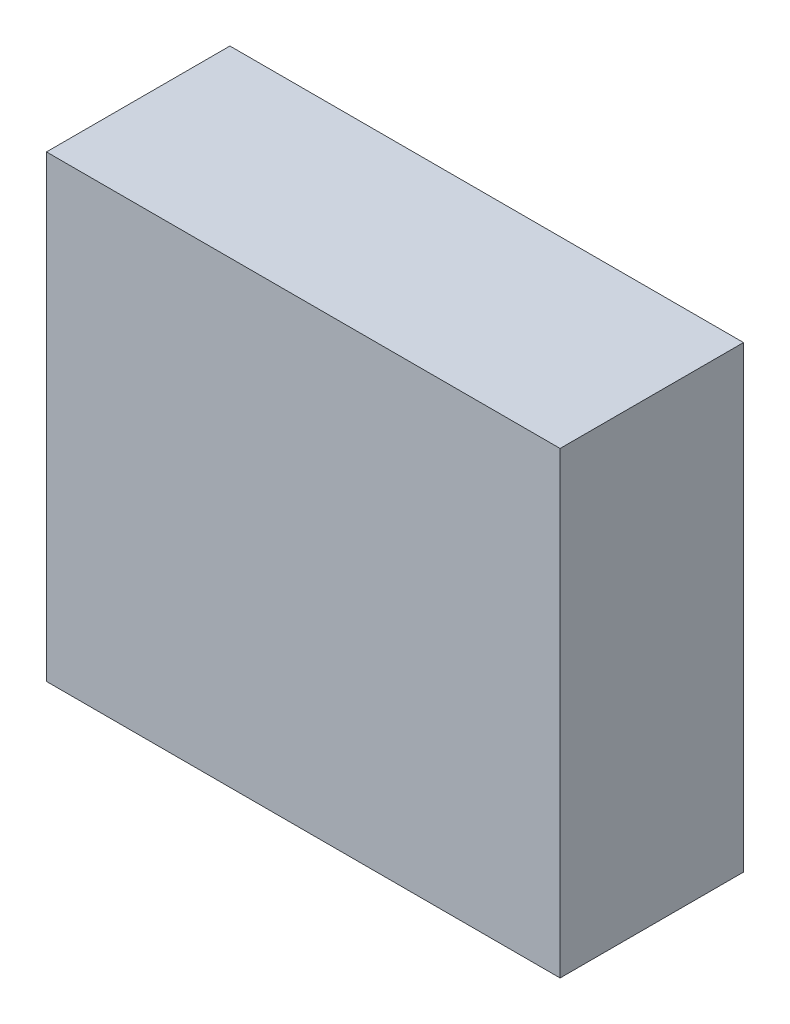
ISO-10303-21;
HEADER;
FILE_DESCRIPTION(('STEP AP214'),'2;1');
FILE_NAME('part.step','',(''),(''),'','','');
FILE_SCHEMA(('AUTOMOTIVE_DESIGN { 1 0 10303 214 1 1 1 1 }'));
ENDSEC;
DATA;
#1=APPLICATION_CONTEXT('core data for automotive mechanical design processes');
#2=APPLICATION_PROTOCOL_DEFINITION('international standard','automotive_design',2000,#1);
#3=PRODUCT_CONTEXT('',#1,'mechanical');
#4=PRODUCT('Part','Part','',(#3));
#5=PRODUCT_RELATED_PRODUCT_CATEGORY('part','',(#4));
#6=PRODUCT_DEFINITION_FORMATION('','',#4);
#7=PRODUCT_DEFINITION_CONTEXT('part definition',#1,'design');
#8=PRODUCT_DEFINITION('design','',#6,#7);
#9=PRODUCT_DEFINITION_SHAPE('','',#8);
#10=(LENGTH_UNIT() NAMED_UNIT(*) SI_UNIT(.MILLI.,.METRE.));
#11=(NAMED_UNIT(*) PLANE_ANGLE_UNIT() SI_UNIT($,.RADIAN.));
#12=(NAMED_UNIT(*) SI_UNIT($,.STERADIAN.) SOLID_ANGLE_UNIT());
#13=UNCERTAINTY_MEASURE_WITH_UNIT(LENGTH_MEASURE(1.E-05),#10,'distance_accuracy_value','');
#14=(GEOMETRIC_REPRESENTATION_CONTEXT(3) GLOBAL_UNCERTAINTY_ASSIGNED_CONTEXT((#13)) GLOBAL_UNIT_ASSIGNED_CONTEXT((#10,
#11,#12)) REPRESENTATION_CONTEXT('',''));
#15=CARTESIAN_POINT('',(0.,0.,0.));
#16=DIRECTION('',(0.,0.,1.));
#17=DIRECTION('',(1.,0.,0.));
#18=AXIS2_PLACEMENT_3D('',#15,#16,#17);
#19=CARTESIAN_POINT('',(-5.59999642,5.00000524,3.99999962));
#20=DIRECTION('',(0.,0.,-1.));
#21=DIRECTION('',(-1.,0.,0.));
#22=AXIS2_PLACEMENT_3D('',#19,#20,#21);
#23=PLANE('',#22);
#24=DIRECTION('',(0.999999999999769,-6.80357269673343E-07,0.));
#25=VECTOR('',#24,1.);
#26=CARTESIAN_POINT('',(-5.60000322357291,-4.9999950799971,3.99999962));
#27=LINE('',#26,#25);
#28=CARTESIAN_POINT('',(-5.59999896,-4.99999508,3.99999962));
#29=VERTEX_POINT('',#28);
#30=CARTESIAN_POINT('',(5.59999896,-5.0000027,3.99999962));
#31=VERTEX_POINT('',#30);
#32=EDGE_CURVE('E59',#29,#31,#27,.T.);
#33=ORIENTED_EDGE('',*,*,#32,.T.);
#34=DIRECTION('',(2.53999991571792E-07,0.999999999999968,0.));
#35=VECTOR('',#34,1.);
#36=CARTESIAN_POINT('',(5.60000150000121,5.00000239520062,3.99999962));
#37=LINE('',#36,#35);
#38=CARTESIAN_POINT('',(5.6000015,4.99999762,3.99999962));
#39=VERTEX_POINT('',#38);
#40=EDGE_CURVE('E56',#31,#39,#37,.T.);
#41=ORIENTED_EDGE('',*,*,#40,.T.);
#42=DIRECTION('',(-0.999999999999769,6.80357269673343E-07,0.));
#43=VECTOR('',#42,1.);
#44=CARTESIAN_POINT('',(-5.59999642,5.00000524000001,3.99999962));
#45=LINE('',#44,#43);
#46=CARTESIAN_POINT('',(-5.59999642,5.00000524,3.99999962));
#47=VERTEX_POINT('',#46);
#48=EDGE_CURVE('E20',#39,#47,#45,.T.);
#49=ORIENTED_EDGE('',*,*,#48,.T.);
#50=DIRECTION('',(-2.53999991571792E-07,-0.999999999999968,0.));
#51=VECTOR('',#50,1.);
#52=CARTESIAN_POINT('',(-5.59999642,5.00000524,3.99999962));
#53=LINE('',#52,#51);
#54=EDGE_CURVE('E85',#47,#29,#53,.T.);
#55=ORIENTED_EDGE('',*,*,#54,.T.);
#56=EDGE_LOOP('',(#33,#41,#49,#55));
#57=FACE_BOUND('',#56,.T.);
#58=ADVANCED_FACE('F17',(#57),#23,.F.);
#59=CARTESIAN_POINT('',(5.6000015,4.99999762,0.));
#60=DIRECTION('',(-6.80357269673343E-07,-0.999999999999769,0.));
#61=DIRECTION('',(0.999999999999769,-6.80357269673343E-07,0.));
#62=AXIS2_PLACEMENT_3D('',#59,#60,#61);
#63=PLANE('',#62);
#64=DIRECTION('',(0.,0.,1.));
#65=VECTOR('',#64,1.);
#66=CARTESIAN_POINT('',(-5.59999642,5.00000524,0.));
#67=LINE('',#66,#65);
#68=CARTESIAN_POINT('',(-5.59999642,5.00000524,0.));
#69=VERTEX_POINT('',#68);
#70=EDGE_CURVE('E68',#69,#47,#67,.T.);
#71=ORIENTED_EDGE('',*,*,#70,.T.);
#72=ORIENTED_EDGE('',*,*,#48,.F.);
#73=DIRECTION('',(0.,0.,1.));
#74=VECTOR('',#73,1.);
#75=CARTESIAN_POINT('',(5.6000015,4.99999762,0.));
#76=LINE('',#75,#74);
#77=CARTESIAN_POINT('',(5.6000015,4.99999762,0.));
#78=VERTEX_POINT('',#77);
#79=EDGE_CURVE('E63',#39,#78,#76,.F.);
#80=ORIENTED_EDGE('',*,*,#79,.T.);
#81=DIRECTION('',(0.999999999999769,-6.80357269673343E-07,0.));
#82=VECTOR('',#81,1.);
#83=CARTESIAN_POINT('',(5.6000015,4.99999762,0.));
#84=LINE('',#83,#82);
#85=EDGE_CURVE('E83',#69,#78,#84,.T.);
#86=ORIENTED_EDGE('',*,*,#85,.F.);
#87=EDGE_LOOP('',(#71,#72,#80,#86));
#88=FACE_BOUND('',#87,.T.);
#89=ADVANCED_FACE('F65',(#88),#63,.F.);
#90=CARTESIAN_POINT('',(5.59999896,-5.0000027,0.));
#91=DIRECTION('',(-0.999999999999968,2.53999991571792E-07,0.));
#92=DIRECTION('',(-2.53999991571792E-07,-0.999999999999968,0.));
#93=AXIS2_PLACEMENT_3D('',#90,#91,#92);
#94=PLANE('',#93);
#95=ORIENTED_EDGE('',*,*,#79,.F.);
#96=ORIENTED_EDGE('',*,*,#40,.F.);
#97=DIRECTION('',(0.,0.,1.));
#98=VECTOR('',#97,1.);
#99=CARTESIAN_POINT('',(5.59999896,-5.0000027,0.));
#100=LINE('',#99,#98);
#101=CARTESIAN_POINT('',(5.59999896,-5.0000027,0.));
#102=VERTEX_POINT('',#101);
#103=EDGE_CURVE('E75',#31,#102,#100,.F.);
#104=ORIENTED_EDGE('',*,*,#103,.T.);
#105=DIRECTION('',(-2.53999991571792E-07,-0.999999999999968,0.));
#106=VECTOR('',#105,1.);
#107=CARTESIAN_POINT('',(5.59999896,-5.0000027,0.));
#108=LINE('',#107,#106);
#109=EDGE_CURVE('E72',#78,#102,#108,.T.);
#110=ORIENTED_EDGE('',*,*,#109,.F.);
#111=EDGE_LOOP('',(#95,#96,#104,#110));
#112=FACE_BOUND('',#111,.T.);
#113=ADVANCED_FACE('F70',(#112),#94,.F.);
#114=CARTESIAN_POINT('',(-5.59999896,-4.99999508,0.));
#115=DIRECTION('',(6.80357269673343E-07,0.999999999999769,0.));
#116=DIRECTION('',(-0.999999999999769,6.80357269673343E-07,0.));
#117=AXIS2_PLACEMENT_3D('',#114,#115,#116);
#118=PLANE('',#117);
#119=ORIENTED_EDGE('',*,*,#103,.F.);
#120=ORIENTED_EDGE('',*,*,#32,.F.);
#121=DIRECTION('',(0.,0.,1.));
#122=VECTOR('',#121,1.);
#123=CARTESIAN_POINT('',(-5.59999896,-4.99999508,0.));
#124=LINE('',#123,#122);
#125=CARTESIAN_POINT('',(-5.59999896,-4.99999508,0.));
#126=VERTEX_POINT('',#125);
#127=EDGE_CURVE('E35',#29,#126,#124,.F.);
#128=ORIENTED_EDGE('',*,*,#127,.T.);
#129=DIRECTION('',(-0.999999999999769,6.80357269673343E-07,0.));
#130=VECTOR('',#129,1.);
#131=CARTESIAN_POINT('',(-5.59999896,-4.99999508,0.));
#132=LINE('',#131,#130);
#133=EDGE_CURVE('E26',#102,#126,#132,.T.);
#134=ORIENTED_EDGE('',*,*,#133,.F.);
#135=EDGE_LOOP('',(#119,#120,#128,#134));
#136=FACE_BOUND('',#135,.T.);
#137=ADVANCED_FACE('F87',(#136),#118,.F.);
#138=CARTESIAN_POINT('',(-5.59999642,5.00000524,0.));
#139=DIRECTION('',(0.999999999999968,-2.53999991571792E-07,0.));
#140=DIRECTION('',(2.53999991571792E-07,0.999999999999968,0.));
#141=AXIS2_PLACEMENT_3D('',#138,#139,#140);
#142=PLANE('',#141);
#143=ORIENTED_EDGE('',*,*,#127,.F.);
#144=ORIENTED_EDGE('',*,*,#54,.F.);
#145=ORIENTED_EDGE('',*,*,#70,.F.);
#146=DIRECTION('',(2.53999991571792E-07,0.999999999999968,0.));
#147=VECTOR('',#146,1.);
#148=CARTESIAN_POINT('',(-5.59999642,5.00000524,0.));
#149=LINE('',#148,#147);
#150=EDGE_CURVE('E11',#126,#69,#149,.T.);
#151=ORIENTED_EDGE('',*,*,#150,.F.);
#152=EDGE_LOOP('',(#143,#144,#145,#151));
#153=FACE_BOUND('',#152,.T.);
#154=ADVANCED_FACE('F91',(#153),#142,.F.);
#155=CARTESIAN_POINT('',(-5.59999642,5.00000524,0.));
#156=DIRECTION('',(0.,0.,-1.));
#157=DIRECTION('',(-1.,0.,0.));
#158=AXIS2_PLACEMENT_3D('',#155,#156,#157);
#159=PLANE('',#158);
#160=ORIENTED_EDGE('',*,*,#133,.T.);
#161=ORIENTED_EDGE('',*,*,#150,.T.);
#162=ORIENTED_EDGE('',*,*,#85,.T.);
#163=ORIENTED_EDGE('',*,*,#109,.T.);
#164=EDGE_LOOP('',(#160,#161,#162,#163));
#165=FACE_BOUND('',#164,.T.);
#166=ADVANCED_FACE('F89',(#165),#159,.T.);
#167=CLOSED_SHELL('',(#58,#89,#113,#137,#154,#166));
#168=MANIFOLD_SOLID_BREP('B1',#167);
#169=ADVANCED_BREP_SHAPE_REPRESENTATION('',(#18,#168),#14);
#170=SHAPE_DEFINITION_REPRESENTATION(#9,#169);
ENDSEC;
END-ISO-10303-21;
